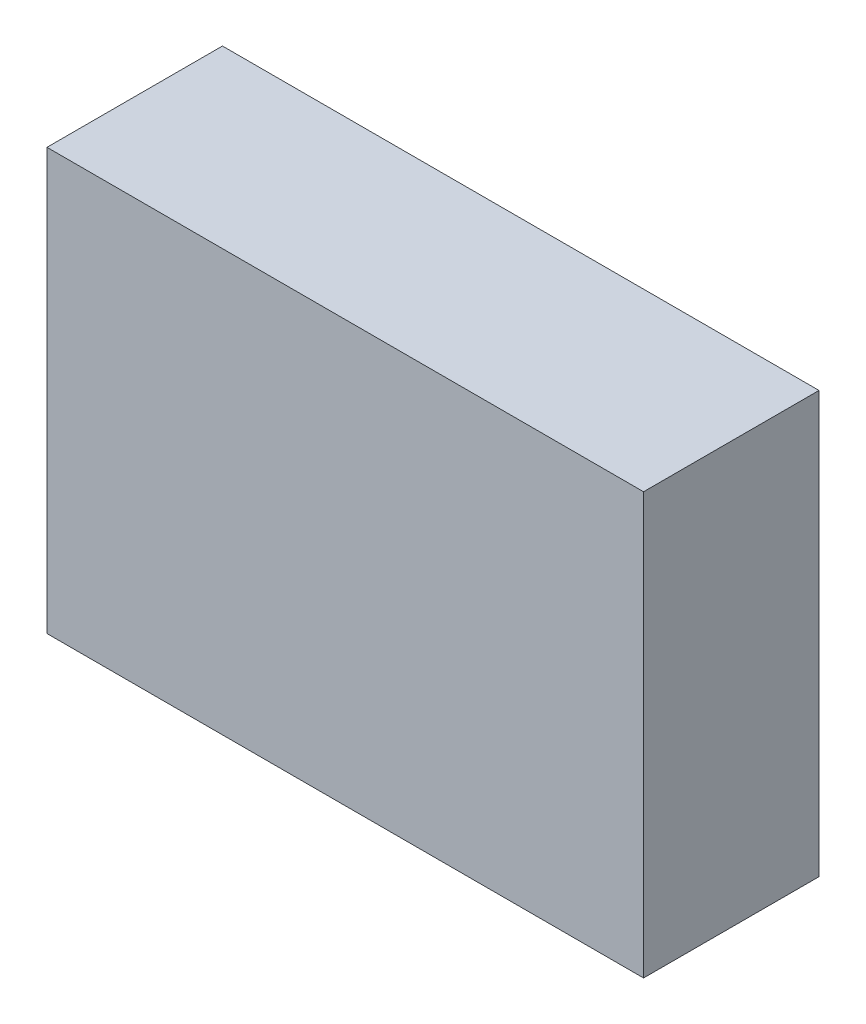
ISO-10303-21;
HEADER;
FILE_DESCRIPTION(('STEP AP214'),'2;1');
FILE_NAME('part.step','',(''),(''),'','','');
FILE_SCHEMA(('AUTOMOTIVE_DESIGN { 1 0 10303 214 1 1 1 1 }'));
ENDSEC;
DATA;
#1=APPLICATION_CONTEXT('core data for automotive mechanical design processes');
#2=APPLICATION_PROTOCOL_DEFINITION('international standard','automotive_design',2000,#1);
#3=PRODUCT_CONTEXT('',#1,'mechanical');
#4=PRODUCT('Part','Part','',(#3));
#5=PRODUCT_RELATED_PRODUCT_CATEGORY('part','',(#4));
#6=PRODUCT_DEFINITION_FORMATION('','',#4);
#7=PRODUCT_DEFINITION_CONTEXT('part definition',#1,'design');
#8=PRODUCT_DEFINITION('design','',#6,#7);
#9=PRODUCT_DEFINITION_SHAPE('','',#8);
#10=(LENGTH_UNIT() NAMED_UNIT(*) SI_UNIT(.MILLI.,.METRE.));
#11=(NAMED_UNIT(*) PLANE_ANGLE_UNIT() SI_UNIT($,.RADIAN.));
#12=(NAMED_UNIT(*) SI_UNIT($,.STERADIAN.) SOLID_ANGLE_UNIT());
#13=UNCERTAINTY_MEASURE_WITH_UNIT(LENGTH_MEASURE(1.E-05),#10,'distance_accuracy_value','');
#14=(GEOMETRIC_REPRESENTATION_CONTEXT(3) GLOBAL_UNCERTAINTY_ASSIGNED_CONTEXT((#13)) GLOBAL_UNIT_ASSIGNED_CONTEXT((#10,
#11,#12)) REPRESENTATION_CONTEXT('',''));
#15=CARTESIAN_POINT('',(0.,0.,0.));
#16=DIRECTION('',(0.,0.,1.));
#17=DIRECTION('',(1.,0.,0.));
#18=AXIS2_PLACEMENT_3D('',#15,#16,#17);
#19=CARTESIAN_POINT('',(2.58,1.63,0.));
#20=DIRECTION('',(1.,0.,0.));
#21=DIRECTION('',(0.,0.,1.));
#22=AXIS2_PLACEMENT_3D('',#19,#20,#21);
#23=PLANE('',#22);
#24=DIRECTION('',(0.,1.,0.));
#25=VECTOR('',#24,1.);
#26=CARTESIAN_POINT('',(2.58,1.63,0.1));
#27=LINE('',#26,#25);
#28=CARTESIAN_POINT('',(2.58,1.63,0.1));
#29=VERTEX_POINT('',#28);
#30=CARTESIAN_POINT('',(2.58,1.87,0.1));
#31=VERTEX_POINT('',#30);
#32=EDGE_CURVE('E11',#29,#31,#27,.T.);
#33=ORIENTED_EDGE('',*,*,#32,.T.);
#34=DIRECTION('',(0.,0.,1.));
#35=VECTOR('',#34,1.);
#36=CARTESIAN_POINT('',(2.58,1.87,0.));
#37=LINE('',#36,#35);
#38=CARTESIAN_POINT('',(2.58,1.87,0.));
#39=VERTEX_POINT('',#38);
#40=EDGE_CURVE('E24',#39,#31,#37,.T.);
#41=ORIENTED_EDGE('',*,*,#40,.F.);
#42=DIRECTION('',(0.,1.,0.));
#43=VECTOR('',#42,1.);
#44=CARTESIAN_POINT('',(2.58,1.63,0.));
#45=LINE('',#44,#43);
#46=CARTESIAN_POINT('',(2.58,1.63,0.));
#47=VERTEX_POINT('',#46);
#48=EDGE_CURVE('E86',#47,#39,#45,.T.);
#49=ORIENTED_EDGE('',*,*,#48,.F.);
#50=DIRECTION('',(0.,0.,1.));
#51=VECTOR('',#50,1.);
#52=CARTESIAN_POINT('',(2.58,1.63,0.));
#53=LINE('',#52,#51);
#54=EDGE_CURVE('E36',#47,#29,#53,.T.);
#55=ORIENTED_EDGE('',*,*,#54,.T.);
#56=EDGE_LOOP('',(#33,#41,#49,#55));
#57=FACE_BOUND('',#56,.T.);
#58=ADVANCED_FACE('F17',(#57),#23,.F.);
#59=CARTESIAN_POINT('',(2.92,1.63,0.));
#60=DIRECTION('',(1.,0.,0.));
#61=DIRECTION('',(0.,0.,1.));
#62=AXIS2_PLACEMENT_3D('',#59,#60,#61);
#63=PLANE('',#62);
#64=DIRECTION('',(0.,0.,1.));
#65=VECTOR('',#64,1.);
#66=CARTESIAN_POINT('',(2.92,1.63,0.));
#67=LINE('',#66,#65);
#68=CARTESIAN_POINT('',(2.92,1.63,0.));
#69=VERTEX_POINT('',#68);
#70=CARTESIAN_POINT('',(2.92,1.63,0.1));
#71=VERTEX_POINT('',#70);
#72=EDGE_CURVE('E83',#69,#71,#67,.T.);
#73=ORIENTED_EDGE('',*,*,#72,.F.);
#74=DIRECTION('',(0.,1.,0.));
#75=VECTOR('',#74,1.);
#76=CARTESIAN_POINT('',(2.92,1.63,0.));
#77=LINE('',#76,#75);
#78=CARTESIAN_POINT('',(2.92,1.87,0.));
#79=VERTEX_POINT('',#78);
#80=EDGE_CURVE('E63',#69,#79,#77,.T.);
#81=ORIENTED_EDGE('',*,*,#80,.T.);
#82=DIRECTION('',(0.,0.,1.));
#83=VECTOR('',#82,1.);
#84=CARTESIAN_POINT('',(2.92,1.87,0.));
#85=LINE('',#84,#83);
#86=CARTESIAN_POINT('',(2.92,1.87,0.1));
#87=VERTEX_POINT('',#86);
#88=EDGE_CURVE('E57',#79,#87,#85,.T.);
#89=ORIENTED_EDGE('',*,*,#88,.T.);
#90=DIRECTION('',(0.,1.,0.));
#91=VECTOR('',#90,1.);
#92=CARTESIAN_POINT('',(2.92,1.63,0.1));
#93=LINE('',#92,#91);
#94=EDGE_CURVE('E60',#71,#87,#93,.T.);
#95=ORIENTED_EDGE('',*,*,#94,.F.);
#96=EDGE_LOOP('',(#73,#81,#89,#95));
#97=FACE_BOUND('',#96,.T.);
#98=ADVANCED_FACE('F59',(#97),#63,.T.);
#99=CARTESIAN_POINT('',(2.58,1.63,0.));
#100=DIRECTION('',(0.,1.,0.));
#101=DIRECTION('',(0.,0.,1.));
#102=AXIS2_PLACEMENT_3D('',#99,#100,#101);
#103=PLANE('',#102);
#104=ORIENTED_EDGE('',*,*,#72,.T.);
#105=DIRECTION('',(1.,0.,0.));
#106=VECTOR('',#105,1.);
#107=CARTESIAN_POINT('',(2.58,1.63,0.1));
#108=LINE('',#107,#106);
#109=EDGE_CURVE('E71',#29,#71,#108,.T.);
#110=ORIENTED_EDGE('',*,*,#109,.F.);
#111=ORIENTED_EDGE('',*,*,#54,.F.);
#112=DIRECTION('',(1.,0.,0.));
#113=VECTOR('',#112,1.);
#114=CARTESIAN_POINT('',(2.58,1.63,0.));
#115=LINE('',#114,#113);
#116=EDGE_CURVE('E76',#47,#69,#115,.T.);
#117=ORIENTED_EDGE('',*,*,#116,.T.);
#118=EDGE_LOOP('',(#104,#110,#111,#117));
#119=FACE_BOUND('',#118,.T.);
#120=ADVANCED_FACE('F91',(#119),#103,.F.);
#121=CARTESIAN_POINT('',(2.58,1.87,0.));
#122=DIRECTION('',(0.,1.,0.));
#123=DIRECTION('',(0.,0.,1.));
#124=AXIS2_PLACEMENT_3D('',#121,#122,#123);
#125=PLANE('',#124);
#126=DIRECTION('',(1.,0.,0.));
#127=VECTOR('',#126,1.);
#128=CARTESIAN_POINT('',(2.58,1.87,0.));
#129=LINE('',#128,#127);
#130=EDGE_CURVE('E74',#39,#79,#129,.T.);
#131=ORIENTED_EDGE('',*,*,#130,.F.);
#132=ORIENTED_EDGE('',*,*,#40,.T.);
#133=DIRECTION('',(1.,0.,0.));
#134=VECTOR('',#133,1.);
#135=CARTESIAN_POINT('',(2.58,1.87,0.1));
#136=LINE('',#135,#134);
#137=EDGE_CURVE('E69',#31,#87,#136,.T.);
#138=ORIENTED_EDGE('',*,*,#137,.T.);
#139=ORIENTED_EDGE('',*,*,#88,.F.);
#140=EDGE_LOOP('',(#131,#132,#138,#139));
#141=FACE_BOUND('',#140,.T.);
#142=ADVANCED_FACE('F73',(#141),#125,.T.);
#143=CARTESIAN_POINT('',(2.58,1.63,0.));
#144=DIRECTION('',(0.,0.,1.));
#145=DIRECTION('',(1.,0.,0.));
#146=AXIS2_PLACEMENT_3D('',#143,#144,#145);
#147=PLANE('',#146);
#148=ORIENTED_EDGE('',*,*,#130,.T.);
#149=ORIENTED_EDGE('',*,*,#80,.F.);
#150=ORIENTED_EDGE('',*,*,#116,.F.);
#151=ORIENTED_EDGE('',*,*,#48,.T.);
#152=EDGE_LOOP('',(#148,#149,#150,#151));
#153=FACE_BOUND('',#152,.T.);
#154=ADVANCED_FACE('F89',(#153),#147,.F.);
#155=CARTESIAN_POINT('',(2.58,1.63,0.1));
#156=DIRECTION('',(0.,0.,1.));
#157=DIRECTION('',(1.,0.,0.));
#158=AXIS2_PLACEMENT_3D('',#155,#156,#157);
#159=PLANE('',#158);
#160=ORIENTED_EDGE('',*,*,#32,.F.);
#161=ORIENTED_EDGE('',*,*,#109,.T.);
#162=ORIENTED_EDGE('',*,*,#94,.T.);
#163=ORIENTED_EDGE('',*,*,#137,.F.);
#164=EDGE_LOOP('',(#160,#161,#162,#163));
#165=FACE_BOUND('',#164,.T.);
#166=ADVANCED_FACE('F68',(#165),#159,.T.);
#167=CLOSED_SHELL('',(#58,#98,#120,#142,#154,#166));
#168=MANIFOLD_SOLID_BREP('B1',#167);
#169=ADVANCED_BREP_SHAPE_REPRESENTATION('',(#18,#168),#14);
#170=SHAPE_DEFINITION_REPRESENTATION(#9,#169);
ENDSEC;
END-ISO-10303-21;
